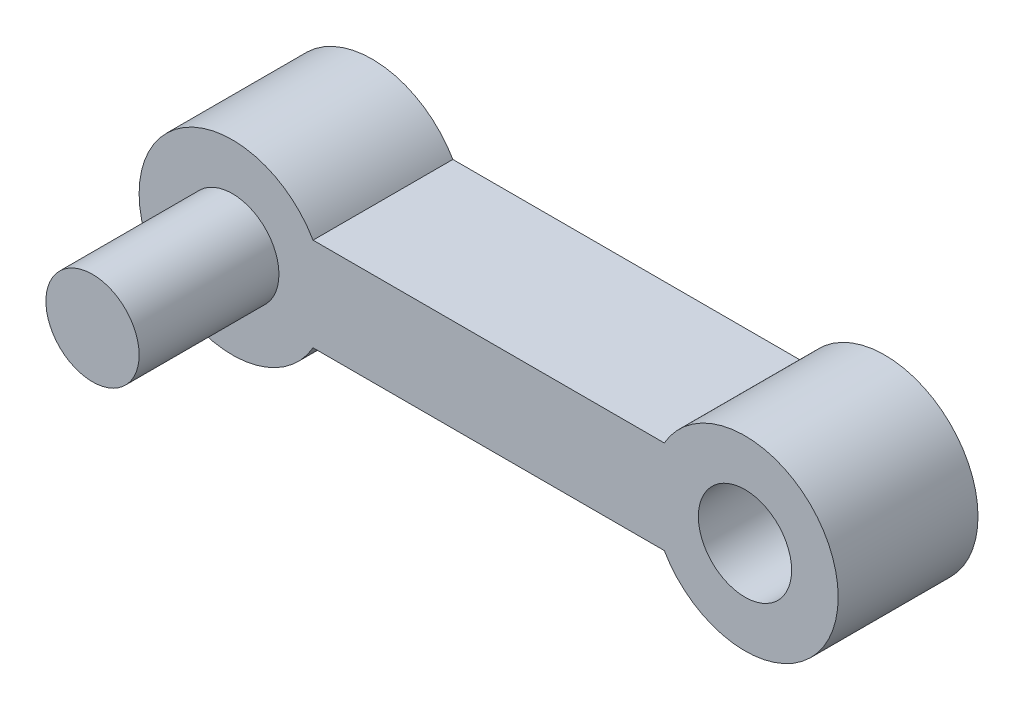
ISO-10303-21;
HEADER;
FILE_DESCRIPTION(('STEP AP214'),'2;1');
FILE_NAME('part.step','',(''),(''),'','','');
FILE_SCHEMA(('AUTOMOTIVE_DESIGN { 1 0 10303 214 1 1 1 1 }'));
ENDSEC;
DATA;
#1=APPLICATION_CONTEXT('core data for automotive mechanical design processes');
#2=APPLICATION_PROTOCOL_DEFINITION('international standard','automotive_design',2000,#1);
#3=PRODUCT_CONTEXT('',#1,'mechanical');
#4=PRODUCT('Part','Part','',(#3));
#5=PRODUCT_RELATED_PRODUCT_CATEGORY('part','',(#4));
#6=PRODUCT_DEFINITION_FORMATION('','',#4);
#7=PRODUCT_DEFINITION_CONTEXT('part definition',#1,'design');
#8=PRODUCT_DEFINITION('design','',#6,#7);
#9=PRODUCT_DEFINITION_SHAPE('','',#8);
#10=(LENGTH_UNIT() NAMED_UNIT(*) SI_UNIT(.MILLI.,.METRE.));
#11=(NAMED_UNIT(*) PLANE_ANGLE_UNIT() SI_UNIT($,.RADIAN.));
#12=(NAMED_UNIT(*) SI_UNIT($,.STERADIAN.) SOLID_ANGLE_UNIT());
#13=UNCERTAINTY_MEASURE_WITH_UNIT(LENGTH_MEASURE(1.E-05),#10,'distance_accuracy_value','');
#14=(GEOMETRIC_REPRESENTATION_CONTEXT(3) GLOBAL_UNCERTAINTY_ASSIGNED_CONTEXT((#13)) GLOBAL_UNIT_ASSIGNED_CONTEXT((#10,
#11,#12)) REPRESENTATION_CONTEXT('',''));
#15=CARTESIAN_POINT('',(0.,0.,0.));
#16=DIRECTION('',(0.,0.,1.));
#17=DIRECTION('',(1.,0.,0.));
#18=AXIS2_PLACEMENT_3D('',#15,#16,#17);
#19=CARTESIAN_POINT('',(-27.2370553074588,12.8003400418104,3.));
#20=DIRECTION('',(0.,0.,-1.));
#21=DIRECTION('',(-1.,0.,0.));
#22=AXIS2_PLACEMENT_3D('',#19,#20,#21);
#23=CYLINDRICAL_SURFACE('',#22,2.);
#24=CARTESIAN_POINT('',(-27.2370553074588,12.8003400418104,0.));
#25=DIRECTION('',(0.,0.,1.));
#26=DIRECTION('',(1.,0.,0.));
#27=AXIS2_PLACEMENT_3D('',#24,#25,#26);
#28=CIRCLE('',#27,2.);
#29=CARTESIAN_POINT('',(-28.9691061150277,13.8003400418104,0.));
#30=VERTEX_POINT('',#29);
#31=CARTESIAN_POINT('',(-28.9691061150277,11.8003400418104,0.));
#32=VERTEX_POINT('',#31);
#33=EDGE_CURVE('E101',#30,#32,#28,.F.);
#34=ORIENTED_EDGE('',*,*,#33,.F.);
#35=DIRECTION('',(0.,0.,-1.));
#36=VECTOR('',#35,1.);
#37=CARTESIAN_POINT('',(-28.9691061150277,13.8003400418104,3.));
#38=LINE('',#37,#36);
#39=CARTESIAN_POINT('',(-28.9691061150277,13.8003400418104,3.));
#40=VERTEX_POINT('',#39);
#41=EDGE_CURVE('E11',#40,#30,#38,.T.);
#42=ORIENTED_EDGE('',*,*,#41,.F.);
#43=CARTESIAN_POINT('',(-27.2370553074588,12.8003400418104,3.));
#44=DIRECTION('',(0.,0.,1.));
#45=DIRECTION('',(1.,0.,0.));
#46=AXIS2_PLACEMENT_3D('',#43,#44,#45);
#47=CIRCLE('',#46,2.);
#48=CARTESIAN_POINT('',(-28.9691061150277,11.8003400418104,3.));
#49=VERTEX_POINT('',#48);
#50=EDGE_CURVE('E94',#40,#49,#47,.F.);
#51=ORIENTED_EDGE('',*,*,#50,.T.);
#52=DIRECTION('',(0.,0.,-1.));
#53=VECTOR('',#52,1.);
#54=CARTESIAN_POINT('',(-28.9691061150277,11.8003400418104,3.));
#55=LINE('',#54,#53);
#56=EDGE_CURVE('E75',#49,#32,#55,.T.);
#57=ORIENTED_EDGE('',*,*,#56,.T.);
#58=EDGE_LOOP('',(#34,#42,#51,#57));
#59=FACE_BOUND('',#58,.T.);
#60=ADVANCED_FACE('F37',(#59),#23,.T.);
#61=CARTESIAN_POINT('',(0.,13.8003400418104,3.));
#62=DIRECTION('',(0.,1.,0.));
#63=DIRECTION('',(-1.,0.,0.));
#64=AXIS2_PLACEMENT_3D('',#61,#62,#63);
#65=PLANE('',#64);
#66=DIRECTION('',(1.,0.,0.));
#67=VECTOR('',#66,1.);
#68=CARTESIAN_POINT('',(0.,13.8003400418104,0.));
#69=LINE('',#68,#67);
#70=CARTESIAN_POINT('',(-36.50500449989,13.8003400418104,0.));
#71=VERTEX_POINT('',#70);
#72=EDGE_CURVE('E88',#71,#30,#69,.T.);
#73=ORIENTED_EDGE('',*,*,#72,.F.);
#74=DIRECTION('',(0.,0.,-1.));
#75=VECTOR('',#74,1.);
#76=CARTESIAN_POINT('',(-36.50500449989,13.8003400418104,3.));
#77=LINE('',#76,#75);
#78=CARTESIAN_POINT('',(-36.50500449989,13.8003400418104,3.));
#79=VERTEX_POINT('',#78);
#80=EDGE_CURVE('E45',#79,#71,#77,.T.);
#81=ORIENTED_EDGE('',*,*,#80,.F.);
#82=DIRECTION('',(1.,0.,0.));
#83=VECTOR('',#82,1.);
#84=CARTESIAN_POINT('',(0.,13.8003400418104,3.));
#85=LINE('',#84,#83);
#86=EDGE_CURVE('E86',#79,#40,#85,.T.);
#87=ORIENTED_EDGE('',*,*,#86,.T.);
#88=ORIENTED_EDGE('',*,*,#41,.T.);
#89=EDGE_LOOP('',(#73,#81,#87,#88));
#90=FACE_BOUND('',#89,.T.);
#91=ADVANCED_FACE('F84',(#90),#65,.T.);
#92=CARTESIAN_POINT('',(-38.2370553074588,12.8003400418104,3.));
#93=DIRECTION('',(0.,0.,-1.));
#94=DIRECTION('',(-1.,0.,0.));
#95=AXIS2_PLACEMENT_3D('',#92,#93,#94);
#96=CYLINDRICAL_SURFACE('',#95,2.);
#97=CARTESIAN_POINT('',(-38.2370553074588,12.8003400418104,0.));
#98=DIRECTION('',(0.,0.,1.));
#99=DIRECTION('',(1.,0.,0.));
#100=AXIS2_PLACEMENT_3D('',#97,#98,#99);
#101=CIRCLE('',#100,2.);
#102=CARTESIAN_POINT('',(-36.50500449989,11.8003400418104,0.));
#103=VERTEX_POINT('',#102);
#104=EDGE_CURVE('E68',#71,#103,#101,.T.);
#105=ORIENTED_EDGE('',*,*,#104,.T.);
#106=DIRECTION('',(0.,0.,-1.));
#107=VECTOR('',#106,1.);
#108=CARTESIAN_POINT('',(-36.50500449989,11.8003400418104,3.));
#109=LINE('',#108,#107);
#110=CARTESIAN_POINT('',(-36.50500449989,11.8003400418104,3.));
#111=VERTEX_POINT('',#110);
#112=EDGE_CURVE('E89',#111,#103,#109,.T.);
#113=ORIENTED_EDGE('',*,*,#112,.F.);
#114=CARTESIAN_POINT('',(-38.2370553074588,12.8003400418104,3.));
#115=DIRECTION('',(0.,0.,1.));
#116=DIRECTION('',(1.,0.,0.));
#117=AXIS2_PLACEMENT_3D('',#114,#115,#116);
#118=CIRCLE('',#117,2.);
#119=EDGE_CURVE('E90',#79,#111,#118,.T.);
#120=ORIENTED_EDGE('',*,*,#119,.F.);
#121=ORIENTED_EDGE('',*,*,#80,.T.);
#122=EDGE_LOOP('',(#105,#113,#120,#121));
#123=FACE_BOUND('',#122,.T.);
#124=ADVANCED_FACE('F91',(#123),#96,.T.);
#125=CARTESIAN_POINT('',(0.,11.8003400418104,3.));
#126=DIRECTION('',(0.,1.,0.));
#127=DIRECTION('',(-1.,0.,0.));
#128=AXIS2_PLACEMENT_3D('',#125,#126,#127);
#129=PLANE('',#128);
#130=DIRECTION('',(1.,0.,0.));
#131=VECTOR('',#130,1.);
#132=CARTESIAN_POINT('',(0.,11.8003400418104,0.));
#133=LINE('',#132,#131);
#134=EDGE_CURVE('E96',#103,#32,#133,.T.);
#135=ORIENTED_EDGE('',*,*,#134,.T.);
#136=ORIENTED_EDGE('',*,*,#56,.F.);
#137=DIRECTION('',(1.,0.,0.));
#138=VECTOR('',#137,1.);
#139=CARTESIAN_POINT('',(0.,11.8003400418104,3.));
#140=LINE('',#139,#138);
#141=EDGE_CURVE('E53',#111,#49,#140,.T.);
#142=ORIENTED_EDGE('',*,*,#141,.F.);
#143=ORIENTED_EDGE('',*,*,#112,.T.);
#144=EDGE_LOOP('',(#135,#136,#142,#143));
#145=FACE_BOUND('',#144,.T.);
#146=ADVANCED_FACE('F111',(#145),#129,.F.);
#147=CARTESIAN_POINT('',(0.,0.,3.));
#148=DIRECTION('',(0.,0.,1.));
#149=DIRECTION('',(1.,0.,0.));
#150=AXIS2_PLACEMENT_3D('',#147,#148,#149);
#151=PLANE('',#150);
#152=CARTESIAN_POINT('',(-27.2370553074588,12.8003400418104,3.));
#153=DIRECTION('',(0.,0.,1.));
#154=DIRECTION('',(1.,0.,0.));
#155=AXIS2_PLACEMENT_3D('',#152,#153,#154);
#156=CIRCLE('',#155,1.);
#157=CARTESIAN_POINT('',(-26.2370553074588,12.8003400418104,3.));
#158=VERTEX_POINT('',#157);
#159=EDGE_CURVE('E150',#158,#158,#156,.F.);
#160=ORIENTED_EDGE('',*,*,#159,.T.);
#161=EDGE_LOOP('',(#160));
#162=FACE_BOUND('',#161,.T.);
#163=CARTESIAN_POINT('',(-38.2370553074588,12.8003400418104,3.));
#164=DIRECTION('',(0.,0.,1.));
#165=DIRECTION('',(1.,0.,0.));
#166=AXIS2_PLACEMENT_3D('',#163,#164,#165);
#167=CIRCLE('',#166,0.999999999999998);
#168=CARTESIAN_POINT('',(-37.2370553074588,12.8003400418104,3.));
#169=VERTEX_POINT('',#168);
#170=EDGE_CURVE('E151',#169,#169,#167,.T.);
#171=ORIENTED_EDGE('',*,*,#170,.F.);
#172=EDGE_LOOP('',(#171));
#173=FACE_BOUND('',#172,.T.);
#174=ORIENTED_EDGE('',*,*,#50,.F.);
#175=ORIENTED_EDGE('',*,*,#86,.F.);
#176=ORIENTED_EDGE('',*,*,#119,.T.);
#177=ORIENTED_EDGE('',*,*,#141,.T.);
#178=EDGE_LOOP('',(#174,#175,#176,#177));
#179=FACE_BOUND('',#178,.T.);
#180=ADVANCED_FACE('F93',(#162,#173,#179),#151,.T.);
#181=CARTESIAN_POINT('',(0.,0.,0.));
#182=DIRECTION('',(0.,0.,1.));
#183=DIRECTION('',(1.,0.,0.));
#184=AXIS2_PLACEMENT_3D('',#181,#182,#183);
#185=PLANE('',#184);
#186=CARTESIAN_POINT('',(-27.2370553074588,12.8003400418104,0.));
#187=DIRECTION('',(0.,0.,-1.));
#188=DIRECTION('',(-1.,0.,0.));
#189=AXIS2_PLACEMENT_3D('',#186,#187,#188);
#190=CIRCLE('',#189,1.);
#191=CARTESIAN_POINT('',(-28.2370553074588,12.8003400418104,0.));
#192=VERTEX_POINT('',#191);
#193=EDGE_CURVE('E147',#192,#192,#190,.T.);
#194=ORIENTED_EDGE('',*,*,#193,.F.);
#195=EDGE_LOOP('',(#194));
#196=FACE_BOUND('',#195,.T.);
#197=ORIENTED_EDGE('',*,*,#33,.T.);
#198=ORIENTED_EDGE('',*,*,#134,.F.);
#199=ORIENTED_EDGE('',*,*,#104,.F.);
#200=ORIENTED_EDGE('',*,*,#72,.T.);
#201=EDGE_LOOP('',(#197,#198,#199,#200));
#202=FACE_BOUND('',#201,.T.);
#203=ADVANCED_FACE('F113',(#196,#202),#185,.F.);
#204=CARTESIAN_POINT('',(-38.2370553074588,12.8003400418104,6.));
#205=DIRECTION('',(0.,0.,-1.));
#206=DIRECTION('',(-1.,0.,0.));
#207=AXIS2_PLACEMENT_3D('',#204,#205,#206);
#208=CYLINDRICAL_SURFACE('',#207,0.999999999999998);
#209=CARTESIAN_POINT('',(-38.2370553074588,12.8003400418104,6.));
#210=DIRECTION('',(0.,0.,1.));
#211=DIRECTION('',(1.,0.,0.));
#212=AXIS2_PLACEMENT_3D('',#209,#210,#211);
#213=CIRCLE('',#212,0.999999999999998);
#214=CARTESIAN_POINT('',(-37.2370553074588,12.8003400418104,6.));
#215=VERTEX_POINT('',#214);
#216=EDGE_CURVE('E104',#215,#215,#213,.T.);
#217=ORIENTED_EDGE('',*,*,#216,.F.);
#218=EDGE_LOOP('',(#217));
#219=FACE_BOUND('',#218,.T.);
#220=ORIENTED_EDGE('',*,*,#170,.T.);
#221=EDGE_LOOP('',(#220));
#222=FACE_BOUND('',#221,.T.);
#223=ADVANCED_FACE('F127',(#219,#222),#208,.T.);
#224=CARTESIAN_POINT('',(-38.2370553074588,12.8003400418104,6.));
#225=DIRECTION('',(0.,0.,1.));
#226=DIRECTION('',(1.,0.,0.));
#227=AXIS2_PLACEMENT_3D('',#224,#225,#226);
#228=PLANE('',#227);
#229=ORIENTED_EDGE('',*,*,#216,.T.);
#230=EDGE_LOOP('',(#229));
#231=FACE_BOUND('',#230,.T.);
#232=ADVANCED_FACE('F134',(#231),#228,.T.);
#233=CARTESIAN_POINT('',(-27.2370553074588,12.8003400418104,5.8284271247462));
#234=DIRECTION('',(0.,0.,-1.));
#235=DIRECTION('',(-1.,0.,0.));
#236=AXIS2_PLACEMENT_3D('',#233,#234,#235);
#237=CYLINDRICAL_SURFACE('',#236,1.);
#238=ORIENTED_EDGE('',*,*,#193,.T.);
#239=EDGE_LOOP('',(#238));
#240=FACE_BOUND('',#239,.T.);
#241=ORIENTED_EDGE('',*,*,#159,.F.);
#242=EDGE_LOOP('',(#241));
#243=FACE_BOUND('',#242,.T.);
#244=ADVANCED_FACE('F138',(#240,#243),#237,.F.);
#245=CLOSED_SHELL('',(#60,#91,#124,#146,#180,#203,#223,#232,#244));
#246=MANIFOLD_SOLID_BREP('B2',#245);
#247=ADVANCED_BREP_SHAPE_REPRESENTATION('',(#18,#246),#14);
#248=SHAPE_DEFINITION_REPRESENTATION(#9,#247);
ENDSEC;
END-ISO-10303-21;
